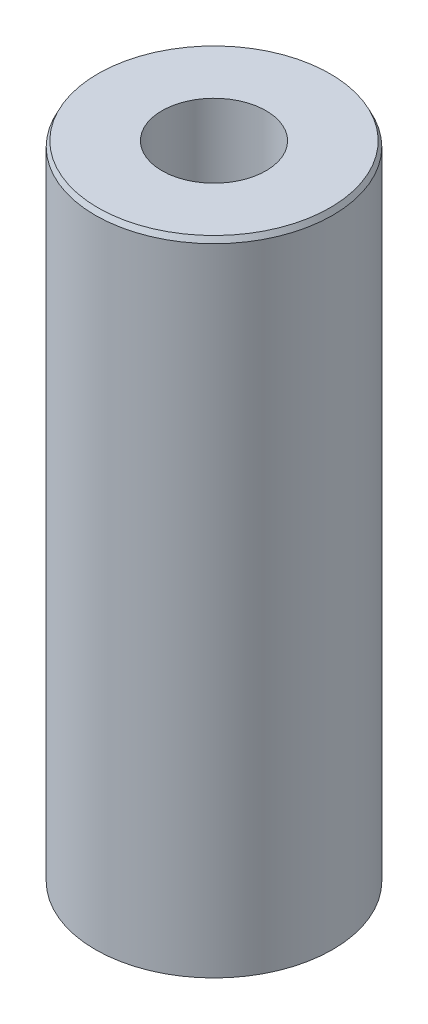
ISO-10303-21;
HEADER;
FILE_DESCRIPTION(('STEP AP214'),'2;1');
FILE_NAME('part.step','',(''),(''),'','','');
FILE_SCHEMA(('AUTOMOTIVE_DESIGN { 1 0 10303 214 1 1 1 1 }'));
ENDSEC;
DATA;
#1=APPLICATION_CONTEXT('core data for automotive mechanical design processes');
#2=APPLICATION_PROTOCOL_DEFINITION('international standard','automotive_design',2000,#1);
#3=PRODUCT_CONTEXT('',#1,'mechanical');
#4=PRODUCT('Part','Part','',(#3));
#5=PRODUCT_RELATED_PRODUCT_CATEGORY('part','',(#4));
#6=PRODUCT_DEFINITION_FORMATION('','',#4);
#7=PRODUCT_DEFINITION_CONTEXT('part definition',#1,'design');
#8=PRODUCT_DEFINITION('design','',#6,#7);
#9=PRODUCT_DEFINITION_SHAPE('','',#8);
#10=(LENGTH_UNIT() NAMED_UNIT(*) SI_UNIT(.MILLI.,.METRE.));
#11=(NAMED_UNIT(*) PLANE_ANGLE_UNIT() SI_UNIT($,.RADIAN.));
#12=(NAMED_UNIT(*) SI_UNIT($,.STERADIAN.) SOLID_ANGLE_UNIT());
#13=UNCERTAINTY_MEASURE_WITH_UNIT(LENGTH_MEASURE(1.E-05),#10,'distance_accuracy_value','');
#14=(GEOMETRIC_REPRESENTATION_CONTEXT(3) GLOBAL_UNCERTAINTY_ASSIGNED_CONTEXT((#13)) GLOBAL_UNIT_ASSIGNED_CONTEXT((#10,
#11,#12)) REPRESENTATION_CONTEXT('',''));
#15=CARTESIAN_POINT('',(0.,0.,0.));
#16=DIRECTION('',(0.,0.,1.));
#17=DIRECTION('',(1.,0.,0.));
#18=AXIS2_PLACEMENT_3D('',#15,#16,#17);
#19=CARTESIAN_POINT('',(0.,284.811464583483,0.));
#20=DIRECTION('',(0.,-1.,0.));
#21=DIRECTION('',(0.,0.,-1.));
#22=AXIS2_PLACEMENT_3D('',#19,#20,#21);
#23=CYLINDRICAL_SURFACE('',#22,52.5);
#24=CARTESIAN_POINT('',(0.,282.477527689642,0.));
#25=DIRECTION('',(0.,1.,0.));
#26=DIRECTION('',(0.,0.,1.));
#27=AXIS2_PLACEMENT_3D('',#24,#25,#26);
#28=CIRCLE('',#27,52.5);
#29=CARTESIAN_POINT('',(0.,282.477527689642,52.5));
#30=VERTEX_POINT('',#29);
#31=EDGE_CURVE('E50',#30,#30,#28,.F.);
#32=ORIENTED_EDGE('',*,*,#31,.T.);
#33=EDGE_LOOP('',(#32));
#34=FACE_BOUND('',#33,.T.);
#35=CARTESIAN_POINT('',(0.,1.13166458793396,0.));
#36=DIRECTION('',(0.,1.,0.));
#37=DIRECTION('',(0.,0.,1.));
#38=AXIS2_PLACEMENT_3D('',#35,#36,#37);
#39=CIRCLE('',#38,52.5);
#40=CARTESIAN_POINT('',(0.,1.13166458793396,52.5));
#41=VERTEX_POINT('',#40);
#42=EDGE_CURVE('E51',#41,#41,#39,.T.);
#43=ORIENTED_EDGE('',*,*,#42,.T.);
#44=EDGE_LOOP('',(#43));
#45=FACE_BOUND('',#44,.T.);
#46=ADVANCED_FACE('F39',(#34,#45),#23,.T.);
#47=CARTESIAN_POINT('',(0.,284.811464583483,0.));
#48=DIRECTION('',(0.,1.,0.));
#49=DIRECTION('',(0.,0.,1.));
#50=AXIS2_PLACEMENT_3D('',#47,#48,#49);
#51=PLANE('',#50);
#52=CARTESIAN_POINT('',(0.,284.811464583483,0.));
#53=DIRECTION('',(0.,1.,0.));
#54=DIRECTION('',(0.,0.,1.));
#55=AXIS2_PLACEMENT_3D('',#52,#53,#54);
#56=CIRCLE('',#55,51.3683354120661);
#57=CARTESIAN_POINT('',(0.,284.811464583483,51.3683354120661));
#58=VERTEX_POINT('',#57);
#59=EDGE_CURVE('E54',#58,#58,#56,.T.);
#60=ORIENTED_EDGE('',*,*,#59,.T.);
#61=EDGE_LOOP('',(#60));
#62=FACE_BOUND('',#61,.T.);
#63=CARTESIAN_POINT('',(0.,284.811464583483,0.));
#64=DIRECTION('',(0.,1.,0.));
#65=DIRECTION('',(0.,0.,1.));
#66=AXIS2_PLACEMENT_3D('',#63,#64,#65);
#67=CIRCLE('',#66,23.0327807331257);
#68=CARTESIAN_POINT('',(0.,284.811464583483,23.0327807331257));
#69=VERTEX_POINT('',#68);
#70=EDGE_CURVE('E58',#69,#69,#67,.T.);
#71=ORIENTED_EDGE('',*,*,#70,.F.);
#72=EDGE_LOOP('',(#71));
#73=FACE_BOUND('',#72,.T.);
#74=ADVANCED_FACE('F69',(#62,#73),#51,.T.);
#75=CARTESIAN_POINT('',(0.,0.,0.));
#76=DIRECTION('',(0.,1.,0.));
#77=DIRECTION('',(0.,0.,1.));
#78=AXIS2_PLACEMENT_3D('',#75,#76,#77);
#79=PLANE('',#78);
#80=CARTESIAN_POINT('',(0.,0.,0.));
#81=DIRECTION('',(0.,1.,0.));
#82=DIRECTION('',(0.,0.,1.));
#83=AXIS2_PLACEMENT_3D('',#80,#81,#82);
#84=CIRCLE('',#83,50.166063106159);
#85=CARTESIAN_POINT('',(0.,0.,50.166063106159));
#86=VERTEX_POINT('',#85);
#87=EDGE_CURVE('E10',#86,#86,#84,.F.);
#88=ORIENTED_EDGE('',*,*,#87,.T.);
#89=EDGE_LOOP('',(#88));
#90=FACE_BOUND('',#89,.T.);
#91=CARTESIAN_POINT('',(0.,0.,0.));
#92=DIRECTION('',(0.,1.,0.));
#93=DIRECTION('',(0.,0.,1.));
#94=AXIS2_PLACEMENT_3D('',#91,#92,#93);
#95=CIRCLE('',#94,23.0327807331257);
#96=CARTESIAN_POINT('',(0.,0.,23.0327807331257));
#97=VERTEX_POINT('',#96);
#98=EDGE_CURVE('E63',#97,#97,#95,.T.);
#99=ORIENTED_EDGE('',*,*,#98,.T.);
#100=EDGE_LOOP('',(#99));
#101=FACE_BOUND('',#100,.T.);
#102=ADVANCED_FACE('F75',(#90,#101),#79,.F.);
#103=CARTESIAN_POINT('',(0.,284.811464583483,0.));
#104=DIRECTION('',(0.,-1.,0.));
#105=DIRECTION('',(0.,0.,-1.));
#106=AXIS2_PLACEMENT_3D('',#103,#104,#105);
#107=CYLINDRICAL_SURFACE('',#106,23.0327807331257);
#108=ORIENTED_EDGE('',*,*,#70,.T.);
#109=EDGE_LOOP('',(#108));
#110=FACE_BOUND('',#109,.T.);
#111=ORIENTED_EDGE('',*,*,#98,.F.);
#112=EDGE_LOOP('',(#111));
#113=FACE_BOUND('',#112,.T.);
#114=ADVANCED_FACE('F70',(#110,#113),#107,.F.);
#115=CARTESIAN_POINT('',(0.,284.811464583483,0.));
#116=DIRECTION('',(0.,-1.,0.));
#117=DIRECTION('',(0.,0.,-1.));
#118=AXIS2_PLACEMENT_3D('',#115,#116,#117);
#119=CONICAL_SURFACE('',#118,51.3683354120661,0.451473497005558);
#120=ORIENTED_EDGE('',*,*,#31,.F.);
#121=EDGE_LOOP('',(#120));
#122=FACE_BOUND('',#121,.T.);
#123=ORIENTED_EDGE('',*,*,#59,.F.);
#124=EDGE_LOOP('',(#123));
#125=FACE_BOUND('',#124,.T.);
#126=ADVANCED_FACE('F81',(#122,#125),#119,.T.);
#127=CARTESIAN_POINT('',(0.,1.13166458793396,0.));
#128=DIRECTION('',(0.,1.,0.));
#129=DIRECTION('',(0.,0.,1.));
#130=AXIS2_PLACEMENT_3D('',#127,#128,#129);
#131=CONICAL_SURFACE('',#130,52.5,1.11932282978934);
#132=ORIENTED_EDGE('',*,*,#87,.F.);
#133=EDGE_LOOP('',(#132));
#134=FACE_BOUND('',#133,.T.);
#135=ORIENTED_EDGE('',*,*,#42,.F.);
#136=EDGE_LOOP('',(#135));
#137=FACE_BOUND('',#136,.T.);
#138=ADVANCED_FACE('F45',(#134,#137),#131,.T.);
#139=CLOSED_SHELL('',(#46,#74,#102,#114,#126,#138));
#140=MANIFOLD_SOLID_BREP('B2',#139);
#141=ADVANCED_BREP_SHAPE_REPRESENTATION('',(#18,#140),#14);
#142=SHAPE_DEFINITION_REPRESENTATION(#9,#141);
ENDSEC;
END-ISO-10303-21;
